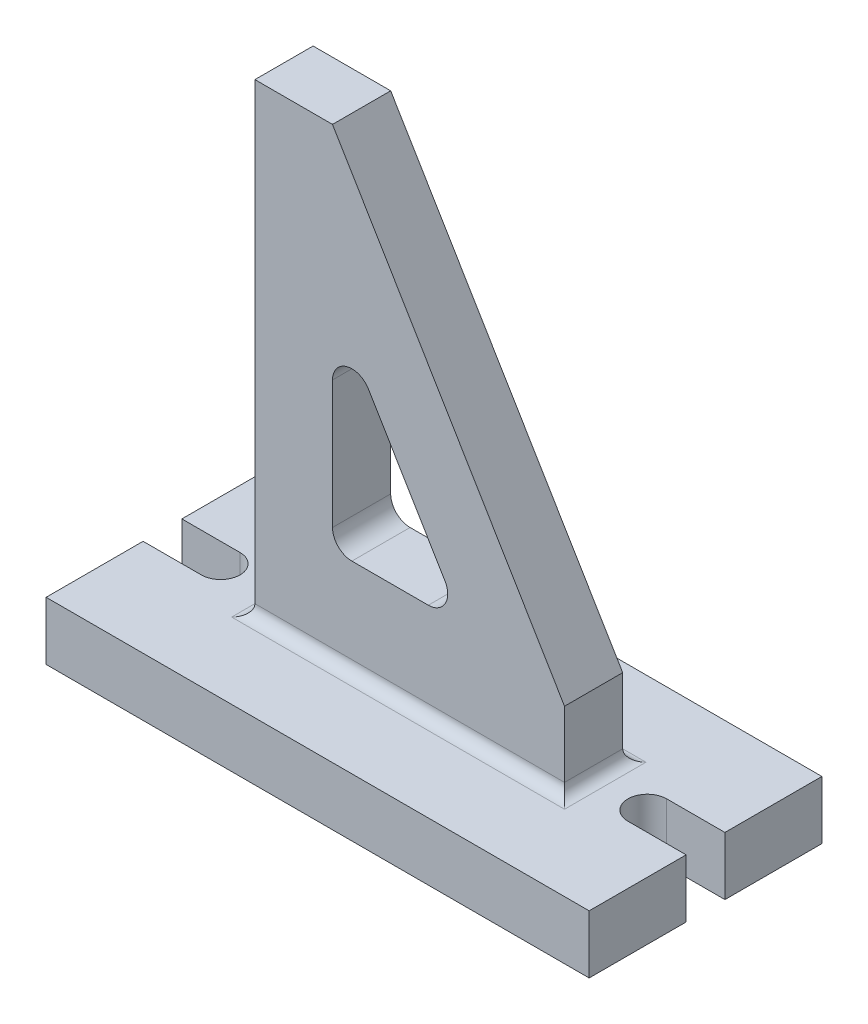
ISO-10303-21;
HEADER;
FILE_DESCRIPTION(('STEP AP214'),'2;1');
FILE_NAME('part.step','',(''),(''),'','','');
FILE_SCHEMA(('AUTOMOTIVE_DESIGN { 1 0 10303 214 1 1 1 1 }'));
ENDSEC;
DATA;
#1=APPLICATION_CONTEXT('core data for automotive mechanical design processes');
#2=APPLICATION_PROTOCOL_DEFINITION('international standard','automotive_design',2000,#1);
#3=PRODUCT_CONTEXT('',#1,'mechanical');
#4=PRODUCT('Part','Part','',(#3));
#5=PRODUCT_RELATED_PRODUCT_CATEGORY('part','',(#4));
#6=PRODUCT_DEFINITION_FORMATION('','',#4);
#7=PRODUCT_DEFINITION_CONTEXT('part definition',#1,'design');
#8=PRODUCT_DEFINITION('design','',#6,#7);
#9=PRODUCT_DEFINITION_SHAPE('','',#8);
#10=(LENGTH_UNIT() NAMED_UNIT(*) SI_UNIT(.MILLI.,.METRE.));
#11=(NAMED_UNIT(*) PLANE_ANGLE_UNIT() SI_UNIT($,.RADIAN.));
#12=(NAMED_UNIT(*) SI_UNIT($,.STERADIAN.) SOLID_ANGLE_UNIT());
#13=UNCERTAINTY_MEASURE_WITH_UNIT(LENGTH_MEASURE(1.E-05),#10,'distance_accuracy_value','');
#14=(GEOMETRIC_REPRESENTATION_CONTEXT(3) GLOBAL_UNCERTAINTY_ASSIGNED_CONTEXT((#13)) GLOBAL_UNIT_ASSIGNED_CONTEXT((#10,
#11,#12)) REPRESENTATION_CONTEXT('',''));
#15=CARTESIAN_POINT('',(0.,0.,0.));
#16=DIRECTION('',(0.,0.,1.));
#17=DIRECTION('',(1.,0.,0.));
#18=AXIS2_PLACEMENT_3D('',#15,#16,#17);
#19=CARTESIAN_POINT('',(-36.4085501426287,0.,9.525));
#20=DIRECTION('',(1.,0.,0.));
#21=DIRECTION('',(0.,0.,-1.));
#22=AXIS2_PLACEMENT_3D('',#19,#20,#21);
#23=PLANE('',#22);
#24=DIRECTION('',(0.,-1.,0.));
#25=VECTOR('',#24,1.);
#26=CARTESIAN_POINT('',(-36.4085501426287,0.,-9.525));
#27=LINE('',#26,#25);
#28=CARTESIAN_POINT('',(-36.4085501426287,76.2,-9.525));
#29=VERTEX_POINT('',#28);
#30=CARTESIAN_POINT('',(-36.4085501426287,3.81,-9.525));
#31=VERTEX_POINT('',#30);
#32=EDGE_CURVE('E271',#29,#31,#27,.T.);
#33=ORIENTED_EDGE('',*,*,#32,.T.);
#34=DIRECTION('',(0.,0.,-1.));
#35=VECTOR('',#34,1.);
#36=CARTESIAN_POINT('',(-36.4085501426287,3.81,9.525));
#37=LINE('',#36,#35);
#38=CARTESIAN_POINT('',(-36.4085501426287,3.81,9.525));
#39=VERTEX_POINT('',#38);
#40=EDGE_CURVE('E11',#31,#39,#37,.F.);
#41=ORIENTED_EDGE('',*,*,#40,.T.);
#42=DIRECTION('',(0.,-1.,0.));
#43=VECTOR('',#42,1.);
#44=CARTESIAN_POINT('',(-36.4085501426287,0.,9.525));
#45=LINE('',#44,#43);
#46=CARTESIAN_POINT('',(-36.4085501426287,76.2,9.525));
#47=VERTEX_POINT('',#46);
#48=EDGE_CURVE('E261',#47,#39,#45,.T.);
#49=ORIENTED_EDGE('',*,*,#48,.F.);
#50=DIRECTION('',(0.,0.,1.));
#51=VECTOR('',#50,1.);
#52=CARTESIAN_POINT('',(-36.4085501426287,76.2,9.525));
#53=LINE('',#52,#51);
#54=EDGE_CURVE('E383',#29,#47,#53,.T.);
#55=ORIENTED_EDGE('',*,*,#54,.F.);
#56=EDGE_LOOP('',(#33,#41,#49,#55));
#57=FACE_BOUND('',#56,.T.);
#58=ADVANCED_FACE('F34',(#57),#23,.F.);
#59=CARTESIAN_POINT('',(-76.2,0.,38.1));
#60=DIRECTION('',(0.,1.,0.));
#61=DIRECTION('',(0.,0.,1.));
#62=AXIS2_PLACEMENT_3D('',#59,#60,#61);
#63=PLANE('',#62);
#64=DIRECTION('',(0.,0.,-1.));
#65=VECTOR('',#64,1.);
#66=CARTESIAN_POINT('',(-40.2185501426287,0.,38.1));
#67=LINE('',#66,#65);
#68=CARTESIAN_POINT('',(-40.2185501426287,0.,13.335));
#69=VERTEX_POINT('',#68);
#70=CARTESIAN_POINT('',(-40.2185501426287,0.,-13.335));
#71=VERTEX_POINT('',#70);
#72=EDGE_CURVE('E386',#69,#71,#67,.T.);
#73=ORIENTED_EDGE('',*,*,#72,.T.);
#74=DIRECTION('',(1.,0.,0.));
#75=VECTOR('',#74,1.);
#76=CARTESIAN_POINT('',(64.9592380234778,0.,-13.335));
#77=LINE('',#76,#75);
#78=CARTESIAN_POINT('',(68.7692380234778,0.,-13.335));
#79=VERTEX_POINT('',#78);
#80=EDGE_CURVE('E392',#71,#79,#77,.T.);
#81=ORIENTED_EDGE('',*,*,#80,.T.);
#82=DIRECTION('',(0.,0.,-1.));
#83=VECTOR('',#82,1.);
#84=CARTESIAN_POINT('',(68.7692380234778,0.,38.1));
#85=LINE('',#84,#83);
#86=CARTESIAN_POINT('',(68.7692380234778,0.,13.335));
#87=VERTEX_POINT('',#86);
#88=EDGE_CURVE('E390',#79,#87,#85,.F.);
#89=ORIENTED_EDGE('',*,*,#88,.T.);
#90=DIRECTION('',(1.,0.,0.));
#91=VECTOR('',#90,1.);
#92=CARTESIAN_POINT('',(-76.2,0.,13.335));
#93=LINE('',#92,#91);
#94=EDGE_CURVE('E388',#87,#69,#93,.F.);
#95=ORIENTED_EDGE('',*,*,#94,.T.);
#96=EDGE_LOOP('',(#73,#81,#89,#95));
#97=FACE_BOUND('',#96,.T.);
#98=DIRECTION('',(1.,0.,0.));
#99=VECTOR('',#98,1.);
#100=CARTESIAN_POINT('',(101.6,0.,-6.35));
#101=LINE('',#100,#99);
#102=CARTESIAN_POINT('',(82.55,0.,-6.35));
#103=VERTEX_POINT('',#102);
#104=CARTESIAN_POINT('',(101.6,0.,-6.35));
#105=VERTEX_POINT('',#104);
#106=EDGE_CURVE('E290',#103,#105,#101,.T.);
#107=ORIENTED_EDGE('',*,*,#106,.T.);
#108=DIRECTION('',(0.,0.,-1.));
#109=VECTOR('',#108,1.);
#110=CARTESIAN_POINT('',(101.6,0.,-38.1));
#111=LINE('',#110,#109);
#112=CARTESIAN_POINT('',(101.6,0.,-38.1));
#113=VERTEX_POINT('',#112);
#114=EDGE_CURVE('E356',#105,#113,#111,.T.);
#115=ORIENTED_EDGE('',*,*,#114,.T.);
#116=DIRECTION('',(-1.,0.,0.));
#117=VECTOR('',#116,1.);
#118=CARTESIAN_POINT('',(-76.2,0.,-38.1));
#119=LINE('',#118,#117);
#120=CARTESIAN_POINT('',(-76.2,0.,-38.1));
#121=VERTEX_POINT('',#120);
#122=EDGE_CURVE('E360',#113,#121,#119,.T.);
#123=ORIENTED_EDGE('',*,*,#122,.T.);
#124=DIRECTION('',(0.,0.,1.));
#125=VECTOR('',#124,1.);
#126=CARTESIAN_POINT('',(-76.2,0.,-38.1));
#127=LINE('',#126,#125);
#128=CARTESIAN_POINT('',(-76.2,0.,-6.34999999999999));
#129=VERTEX_POINT('',#128);
#130=EDGE_CURVE('E350',#121,#129,#127,.T.);
#131=ORIENTED_EDGE('',*,*,#130,.T.);
#132=DIRECTION('',(-1.,0.,0.));
#133=VECTOR('',#132,1.);
#134=CARTESIAN_POINT('',(-76.2,0.,-6.34999999999999));
#135=LINE('',#134,#133);
#136=CARTESIAN_POINT('',(-57.15,0.,-6.35));
#137=VERTEX_POINT('',#136);
#138=EDGE_CURVE('E313',#137,#129,#135,.T.);
#139=ORIENTED_EDGE('',*,*,#138,.F.);
#140=CARTESIAN_POINT('',(-57.15,0.,0.));
#141=DIRECTION('',(0.,1.,0.));
#142=DIRECTION('',(0.,0.,-1.));
#143=AXIS2_PLACEMENT_3D('',#140,#141,#142);
#144=CIRCLE('',#143,6.35);
#145=CARTESIAN_POINT('',(-57.15,0.,6.35));
#146=VERTEX_POINT('',#145);
#147=EDGE_CURVE('E322',#146,#137,#144,.T.);
#148=ORIENTED_EDGE('',*,*,#147,.F.);
#149=DIRECTION('',(1.,0.,0.));
#150=VECTOR('',#149,1.);
#151=CARTESIAN_POINT('',(-76.2,0.,6.35));
#152=LINE('',#151,#150);
#153=CARTESIAN_POINT('',(-76.2,0.,6.35));
#154=VERTEX_POINT('',#153);
#155=EDGE_CURVE('E303',#154,#146,#152,.T.);
#156=ORIENTED_EDGE('',*,*,#155,.F.);
#157=CARTESIAN_POINT('',(-76.2,0.,38.1));
#158=VERTEX_POINT('',#157);
#159=EDGE_CURVE('E329',#154,#158,#127,.T.);
#160=ORIENTED_EDGE('',*,*,#159,.T.);
#161=DIRECTION('',(1.,0.,0.));
#162=VECTOR('',#161,1.);
#163=CARTESIAN_POINT('',(-76.2,0.,38.1));
#164=LINE('',#163,#162);
#165=CARTESIAN_POINT('',(101.6,0.,38.1));
#166=VERTEX_POINT('',#165);
#167=EDGE_CURVE('E353',#158,#166,#164,.T.);
#168=ORIENTED_EDGE('',*,*,#167,.T.);
#169=CARTESIAN_POINT('',(101.6,0.,6.35));
#170=VERTEX_POINT('',#169);
#171=EDGE_CURVE('E357',#166,#170,#111,.T.);
#172=ORIENTED_EDGE('',*,*,#171,.T.);
#173=DIRECTION('',(-1.,0.,0.));
#174=VECTOR('',#173,1.);
#175=CARTESIAN_POINT('',(101.6,0.,6.35));
#176=LINE('',#175,#174);
#177=CARTESIAN_POINT('',(82.55,0.,6.35));
#178=VERTEX_POINT('',#177);
#179=EDGE_CURVE('E283',#170,#178,#176,.T.);
#180=ORIENTED_EDGE('',*,*,#179,.T.);
#181=CARTESIAN_POINT('',(82.55,0.,0.));
#182=DIRECTION('',(0.,-1.,0.));
#183=DIRECTION('',(0.,0.,-1.));
#184=AXIS2_PLACEMENT_3D('',#181,#182,#183);
#185=CIRCLE('',#184,6.35);
#186=EDGE_CURVE('E286',#178,#103,#185,.T.);
#187=ORIENTED_EDGE('',*,*,#186,.T.);
#188=EDGE_LOOP('',(#107,#115,#123,#131,#139,#148,#156,#160,#168,#172,#180,#187));
#189=FACE_BOUND('',#188,.T.);
#190=ADVANCED_FACE('F450',(#97,#189),#63,.T.);
#191=CARTESIAN_POINT('',(101.6,-19.05,-38.1));
#192=DIRECTION('',(1.,0.,0.));
#193=DIRECTION('',(0.,0.,-1.));
#194=AXIS2_PLACEMENT_3D('',#191,#192,#193);
#195=PLANE('',#194);
#196=DIRECTION('',(0.,-1.,0.));
#197=VECTOR('',#196,1.);
#198=CARTESIAN_POINT('',(101.6,0.,-6.35));
#199=LINE('',#198,#197);
#200=CARTESIAN_POINT('',(101.6,-19.05,-6.35));
#201=VERTEX_POINT('',#200);
#202=EDGE_CURVE('E300',#105,#201,#199,.T.);
#203=ORIENTED_EDGE('',*,*,#202,.T.);
#204=DIRECTION('',(0.,0.,-1.));
#205=VECTOR('',#204,1.);
#206=CARTESIAN_POINT('',(101.6,-19.05,-38.1));
#207=LINE('',#206,#205);
#208=CARTESIAN_POINT('',(101.6,-19.05,-38.1));
#209=VERTEX_POINT('',#208);
#210=EDGE_CURVE('E342',#201,#209,#207,.T.);
#211=ORIENTED_EDGE('',*,*,#210,.T.);
#212=DIRECTION('',(0.,1.,0.));
#213=VECTOR('',#212,1.);
#214=CARTESIAN_POINT('',(101.6,-19.05,-38.1));
#215=LINE('',#214,#213);
#216=EDGE_CURVE('E366',#209,#113,#215,.T.);
#217=ORIENTED_EDGE('',*,*,#216,.T.);
#218=ORIENTED_EDGE('',*,*,#114,.F.);
#219=EDGE_LOOP('',(#203,#211,#217,#218));
#220=FACE_BOUND('',#219,.T.);
#221=ADVANCED_FACE('F466',(#220),#195,.T.);
#222=CARTESIAN_POINT('',(-76.2,-19.05,-38.1));
#223=DIRECTION('',(-1.,0.,0.));
#224=DIRECTION('',(0.,0.,1.));
#225=AXIS2_PLACEMENT_3D('',#222,#223,#224);
#226=PLANE('',#225);
#227=DIRECTION('',(0.,1.,0.));
#228=VECTOR('',#227,1.);
#229=CARTESIAN_POINT('',(-76.2,-19.05,-6.34999999999999));
#230=LINE('',#229,#228);
#231=CARTESIAN_POINT('',(-76.2,-19.05,-6.34999999999999));
#232=VERTEX_POINT('',#231);
#233=EDGE_CURVE('E326',#232,#129,#230,.T.);
#234=ORIENTED_EDGE('',*,*,#233,.T.);
#235=ORIENTED_EDGE('',*,*,#130,.F.);
#236=DIRECTION('',(0.,1.,0.));
#237=VECTOR('',#236,1.);
#238=CARTESIAN_POINT('',(-76.2,-19.05,-38.1));
#239=LINE('',#238,#237);
#240=CARTESIAN_POINT('',(-76.2,-19.05,-38.1));
#241=VERTEX_POINT('',#240);
#242=EDGE_CURVE('E363',#241,#121,#239,.T.);
#243=ORIENTED_EDGE('',*,*,#242,.F.);
#244=DIRECTION('',(0.,0.,1.));
#245=VECTOR('',#244,1.);
#246=CARTESIAN_POINT('',(-76.2,-19.05,-38.1));
#247=LINE('',#246,#245);
#248=EDGE_CURVE('E335',#241,#232,#247,.T.);
#249=ORIENTED_EDGE('',*,*,#248,.T.);
#250=EDGE_LOOP('',(#234,#235,#243,#249));
#251=FACE_BOUND('',#250,.T.);
#252=ADVANCED_FACE('F537',(#251),#226,.T.);
#253=DIRECTION('',(0.,1.,0.));
#254=VECTOR('',#253,1.);
#255=CARTESIAN_POINT('',(-76.2,-19.05,6.35));
#256=LINE('',#255,#254);
#257=CARTESIAN_POINT('',(-76.2,-19.05,6.35));
#258=VERTEX_POINT('',#257);
#259=EDGE_CURVE('E319',#258,#154,#256,.T.);
#260=ORIENTED_EDGE('',*,*,#259,.F.);
#261=CARTESIAN_POINT('',(-76.2,-19.05,38.1));
#262=VERTEX_POINT('',#261);
#263=EDGE_CURVE('E339',#258,#262,#247,.T.);
#264=ORIENTED_EDGE('',*,*,#263,.T.);
#265=DIRECTION('',(0.,1.,0.));
#266=VECTOR('',#265,1.);
#267=CARTESIAN_POINT('',(-76.2,-19.05,38.1));
#268=LINE('',#267,#266);
#269=EDGE_CURVE('E349',#262,#158,#268,.T.);
#270=ORIENTED_EDGE('',*,*,#269,.T.);
#271=ORIENTED_EDGE('',*,*,#159,.F.);
#272=EDGE_LOOP('',(#260,#264,#270,#271));
#273=FACE_BOUND('',#272,.T.);
#274=ADVANCED_FACE('F527',(#273),#226,.T.);
#275=CARTESIAN_POINT('',(-76.2,-19.05,-38.1));
#276=DIRECTION('',(0.,0.,-1.));
#277=DIRECTION('',(-1.,0.,0.));
#278=AXIS2_PLACEMENT_3D('',#275,#276,#277);
#279=PLANE('',#278);
#280=ORIENTED_EDGE('',*,*,#122,.F.);
#281=ORIENTED_EDGE('',*,*,#216,.F.);
#282=DIRECTION('',(-1.,0.,0.));
#283=VECTOR('',#282,1.);
#284=CARTESIAN_POINT('',(-76.2,-19.05,-38.1));
#285=LINE('',#284,#283);
#286=EDGE_CURVE('E346',#209,#241,#285,.T.);
#287=ORIENTED_EDGE('',*,*,#286,.T.);
#288=ORIENTED_EDGE('',*,*,#242,.T.);
#289=EDGE_LOOP('',(#280,#281,#287,#288));
#290=FACE_BOUND('',#289,.T.);
#291=ADVANCED_FACE('F523',(#290),#279,.T.);
#292=DIRECTION('',(0.,-1.,0.));
#293=VECTOR('',#292,1.);
#294=CARTESIAN_POINT('',(101.6,0.,6.35));
#295=LINE('',#294,#293);
#296=CARTESIAN_POINT('',(101.6,-19.05,6.35));
#297=VERTEX_POINT('',#296);
#298=EDGE_CURVE('E293',#170,#297,#295,.T.);
#299=ORIENTED_EDGE('',*,*,#298,.F.);
#300=ORIENTED_EDGE('',*,*,#171,.F.);
#301=DIRECTION('',(0.,1.,0.));
#302=VECTOR('',#301,1.);
#303=CARTESIAN_POINT('',(101.6,-19.05,38.1));
#304=LINE('',#303,#302);
#305=CARTESIAN_POINT('',(101.6,-19.05,38.1));
#306=VERTEX_POINT('',#305);
#307=EDGE_CURVE('E369',#306,#166,#304,.T.);
#308=ORIENTED_EDGE('',*,*,#307,.F.);
#309=EDGE_CURVE('E343',#306,#297,#207,.T.);
#310=ORIENTED_EDGE('',*,*,#309,.T.);
#311=EDGE_LOOP('',(#299,#300,#308,#310));
#312=FACE_BOUND('',#311,.T.);
#313=ADVANCED_FACE('F526',(#312),#195,.T.);
#314=CARTESIAN_POINT('',(-76.2,-19.05,38.1));
#315=DIRECTION('',(0.,0.,1.));
#316=DIRECTION('',(1.,0.,0.));
#317=AXIS2_PLACEMENT_3D('',#314,#315,#316);
#318=PLANE('',#317);
#319=ORIENTED_EDGE('',*,*,#167,.F.);
#320=ORIENTED_EDGE('',*,*,#269,.F.);
#321=DIRECTION('',(1.,0.,0.));
#322=VECTOR('',#321,1.);
#323=CARTESIAN_POINT('',(-76.2,-19.05,38.1));
#324=LINE('',#323,#322);
#325=EDGE_CURVE('E338',#262,#306,#324,.T.);
#326=ORIENTED_EDGE('',*,*,#325,.T.);
#327=ORIENTED_EDGE('',*,*,#307,.T.);
#328=EDGE_LOOP('',(#319,#320,#326,#327));
#329=FACE_BOUND('',#328,.T.);
#330=ADVANCED_FACE('F520',(#329),#318,.T.);
#331=CARTESIAN_POINT('',(-76.2,-19.05,38.1));
#332=DIRECTION('',(0.,1.,0.));
#333=DIRECTION('',(0.,0.,1.));
#334=AXIS2_PLACEMENT_3D('',#331,#332,#333);
#335=PLANE('',#334);
#336=ORIENTED_EDGE('',*,*,#210,.F.);
#337=DIRECTION('',(1.,0.,0.));
#338=VECTOR('',#337,1.);
#339=CARTESIAN_POINT('',(101.6,-19.05,-6.35));
#340=LINE('',#339,#338);
#341=CARTESIAN_POINT('',(82.55,-19.05,-6.35));
#342=VERTEX_POINT('',#341);
#343=EDGE_CURVE('E287',#342,#201,#340,.T.);
#344=ORIENTED_EDGE('',*,*,#343,.F.);
#345=CARTESIAN_POINT('',(82.55,-19.05,0.));
#346=DIRECTION('',(0.,-1.,0.));
#347=DIRECTION('',(0.,0.,-1.));
#348=AXIS2_PLACEMENT_3D('',#345,#346,#347);
#349=CIRCLE('',#348,6.35);
#350=CARTESIAN_POINT('',(82.55,-19.05,6.35));
#351=VERTEX_POINT('',#350);
#352=EDGE_CURVE('E296',#351,#342,#349,.T.);
#353=ORIENTED_EDGE('',*,*,#352,.F.);
#354=DIRECTION('',(-1.,0.,0.));
#355=VECTOR('',#354,1.);
#356=CARTESIAN_POINT('',(101.6,-19.05,6.35));
#357=LINE('',#356,#355);
#358=EDGE_CURVE('E282',#297,#351,#357,.T.);
#359=ORIENTED_EDGE('',*,*,#358,.F.);
#360=ORIENTED_EDGE('',*,*,#309,.F.);
#361=ORIENTED_EDGE('',*,*,#325,.F.);
#362=ORIENTED_EDGE('',*,*,#263,.F.);
#363=DIRECTION('',(1.,0.,0.));
#364=VECTOR('',#363,1.);
#365=CARTESIAN_POINT('',(-76.2,-19.05,6.35));
#366=LINE('',#365,#364);
#367=CARTESIAN_POINT('',(-57.15,-19.05,6.35));
#368=VERTEX_POINT('',#367);
#369=EDGE_CURVE('E309',#258,#368,#366,.T.);
#370=ORIENTED_EDGE('',*,*,#369,.T.);
#371=CARTESIAN_POINT('',(-57.15,-19.05,0.));
#372=DIRECTION('',(0.,1.,0.));
#373=DIRECTION('',(0.,0.,-1.));
#374=AXIS2_PLACEMENT_3D('',#371,#372,#373);
#375=CIRCLE('',#374,6.35);
#376=CARTESIAN_POINT('',(-57.15,-19.05,-6.35));
#377=VERTEX_POINT('',#376);
#378=EDGE_CURVE('E312',#368,#377,#375,.T.);
#379=ORIENTED_EDGE('',*,*,#378,.T.);
#380=DIRECTION('',(-1.,0.,0.));
#381=VECTOR('',#380,1.);
#382=CARTESIAN_POINT('',(-76.2,-19.05,-6.34999999999999));
#383=LINE('',#382,#381);
#384=EDGE_CURVE('E316',#377,#232,#383,.T.);
#385=ORIENTED_EDGE('',*,*,#384,.T.);
#386=ORIENTED_EDGE('',*,*,#248,.F.);
#387=ORIENTED_EDGE('',*,*,#286,.F.);
#388=EDGE_LOOP('',(#336,#344,#353,#359,#360,#361,#362,#370,#379,#385,#386,#387));
#389=FACE_BOUND('',#388,.T.);
#390=ADVANCED_FACE('F511',(#389),#335,.F.);
#391=CARTESIAN_POINT('',(-76.2,-19.05,-6.34999999999999));
#392=DIRECTION('',(0.,0.,-1.));
#393=DIRECTION('',(-1.,0.,0.));
#394=AXIS2_PLACEMENT_3D('',#391,#392,#393);
#395=PLANE('',#394);
#396=ORIENTED_EDGE('',*,*,#138,.T.);
#397=ORIENTED_EDGE('',*,*,#233,.F.);
#398=ORIENTED_EDGE('',*,*,#384,.F.);
#399=DIRECTION('',(0.,1.,0.));
#400=VECTOR('',#399,1.);
#401=CARTESIAN_POINT('',(-57.15,-19.05,-6.35));
#402=LINE('',#401,#400);
#403=EDGE_CURVE('E330',#377,#137,#402,.T.);
#404=ORIENTED_EDGE('',*,*,#403,.T.);
#405=EDGE_LOOP('',(#396,#397,#398,#404));
#406=FACE_BOUND('',#405,.T.);
#407=ADVANCED_FACE('F507',(#406),#395,.F.);
#408=CARTESIAN_POINT('',(-57.15,-19.05,0.));
#409=DIRECTION('',(0.,1.,0.));
#410=DIRECTION('',(0.,0.,1.));
#411=AXIS2_PLACEMENT_3D('',#408,#409,#410);
#412=CYLINDRICAL_SURFACE('',#411,6.35);
#413=ORIENTED_EDGE('',*,*,#147,.T.);
#414=ORIENTED_EDGE('',*,*,#403,.F.);
#415=ORIENTED_EDGE('',*,*,#378,.F.);
#416=DIRECTION('',(0.,1.,0.));
#417=VECTOR('',#416,1.);
#418=CARTESIAN_POINT('',(-57.15,-19.05,6.35));
#419=LINE('',#418,#417);
#420=EDGE_CURVE('E332',#368,#146,#419,.T.);
#421=ORIENTED_EDGE('',*,*,#420,.T.);
#422=EDGE_LOOP('',(#413,#414,#415,#421));
#423=FACE_BOUND('',#422,.T.);
#424=ADVANCED_FACE('F510',(#423),#412,.F.);
#425=CARTESIAN_POINT('',(-76.2,-19.05,6.35));
#426=DIRECTION('',(0.,0.,1.));
#427=DIRECTION('',(1.,0.,0.));
#428=AXIS2_PLACEMENT_3D('',#425,#426,#427);
#429=PLANE('',#428);
#430=ORIENTED_EDGE('',*,*,#155,.T.);
#431=ORIENTED_EDGE('',*,*,#420,.F.);
#432=ORIENTED_EDGE('',*,*,#369,.F.);
#433=ORIENTED_EDGE('',*,*,#259,.T.);
#434=EDGE_LOOP('',(#430,#431,#432,#433));
#435=FACE_BOUND('',#434,.T.);
#436=ADVANCED_FACE('F502',(#435),#429,.F.);
#437=CARTESIAN_POINT('',(101.6,0.,-6.35));
#438=DIRECTION('',(0.,0.,-1.));
#439=DIRECTION('',(-1.,0.,0.));
#440=AXIS2_PLACEMENT_3D('',#437,#438,#439);
#441=PLANE('',#440);
#442=ORIENTED_EDGE('',*,*,#343,.T.);
#443=ORIENTED_EDGE('',*,*,#202,.F.);
#444=ORIENTED_EDGE('',*,*,#106,.F.);
#445=DIRECTION('',(0.,-1.,0.));
#446=VECTOR('',#445,1.);
#447=CARTESIAN_POINT('',(82.55,0.,-6.35));
#448=LINE('',#447,#446);
#449=EDGE_CURVE('E304',#103,#342,#448,.T.);
#450=ORIENTED_EDGE('',*,*,#449,.T.);
#451=EDGE_LOOP('',(#442,#443,#444,#450));
#452=FACE_BOUND('',#451,.T.);
#453=ADVANCED_FACE('F499',(#452),#441,.F.);
#454=CARTESIAN_POINT('',(82.55,0.,0.));
#455=DIRECTION('',(0.,-1.,0.));
#456=DIRECTION('',(0.,0.,-1.));
#457=AXIS2_PLACEMENT_3D('',#454,#455,#456);
#458=CYLINDRICAL_SURFACE('',#457,6.35);
#459=ORIENTED_EDGE('',*,*,#352,.T.);
#460=ORIENTED_EDGE('',*,*,#449,.F.);
#461=ORIENTED_EDGE('',*,*,#186,.F.);
#462=DIRECTION('',(0.,-1.,0.));
#463=VECTOR('',#462,1.);
#464=CARTESIAN_POINT('',(82.55,0.,6.35));
#465=LINE('',#464,#463);
#466=EDGE_CURVE('E306',#178,#351,#465,.T.);
#467=ORIENTED_EDGE('',*,*,#466,.T.);
#468=EDGE_LOOP('',(#459,#460,#461,#467));
#469=FACE_BOUND('',#468,.T.);
#470=ADVANCED_FACE('F495',(#469),#458,.F.);
#471=CARTESIAN_POINT('',(101.6,0.,6.35));
#472=DIRECTION('',(0.,0.,1.));
#473=DIRECTION('',(1.,0.,0.));
#474=AXIS2_PLACEMENT_3D('',#471,#472,#473);
#475=PLANE('',#474);
#476=ORIENTED_EDGE('',*,*,#358,.T.);
#477=ORIENTED_EDGE('',*,*,#466,.F.);
#478=ORIENTED_EDGE('',*,*,#179,.F.);
#479=ORIENTED_EDGE('',*,*,#298,.T.);
#480=EDGE_LOOP('',(#476,#477,#478,#479));
#481=FACE_BOUND('',#480,.T.);
#482=ADVANCED_FACE('F488',(#481),#475,.F.);
#483=CARTESIAN_POINT('',(64.9592380234778,0.,9.525));
#484=DIRECTION('',(-1.,0.,0.));
#485=DIRECTION('',(0.,0.,1.));
#486=AXIS2_PLACEMENT_3D('',#483,#484,#485);
#487=PLANE('',#486);
#488=DIRECTION('',(0.,1.,0.));
#489=VECTOR('',#488,1.);
#490=CARTESIAN_POINT('',(64.9592380234778,0.,9.525));
#491=LINE('',#490,#489);
#492=CARTESIAN_POINT('',(64.9592380234778,3.81,9.525));
#493=VERTEX_POINT('',#492);
#494=CARTESIAN_POINT('',(64.9592380234778,25.4,9.525));
#495=VERTEX_POINT('',#494);
#496=EDGE_CURVE('E254',#493,#495,#491,.T.);
#497=ORIENTED_EDGE('',*,*,#496,.F.);
#498=DIRECTION('',(0.,0.,-1.));
#499=VECTOR('',#498,1.);
#500=CARTESIAN_POINT('',(64.9592380234778,3.81,9.525));
#501=LINE('',#500,#499);
#502=CARTESIAN_POINT('',(64.9592380234778,3.81,-9.525));
#503=VERTEX_POINT('',#502);
#504=EDGE_CURVE('E398',#493,#503,#501,.T.);
#505=ORIENTED_EDGE('',*,*,#504,.T.);
#506=DIRECTION('',(0.,1.,0.));
#507=VECTOR('',#506,1.);
#508=CARTESIAN_POINT('',(64.9592380234778,0.,-9.525));
#509=LINE('',#508,#507);
#510=CARTESIAN_POINT('',(64.9592380234778,25.4,-9.525));
#511=VERTEX_POINT('',#510);
#512=EDGE_CURVE('E247',#503,#511,#509,.T.);
#513=ORIENTED_EDGE('',*,*,#512,.T.);
#514=DIRECTION('',(0.,0.,-1.));
#515=VECTOR('',#514,1.);
#516=CARTESIAN_POINT('',(64.9592380234778,25.4,9.525));
#517=LINE('',#516,#515);
#518=EDGE_CURVE('E279',#495,#511,#517,.T.);
#519=ORIENTED_EDGE('',*,*,#518,.F.);
#520=EDGE_LOOP('',(#497,#505,#513,#519));
#521=FACE_BOUND('',#520,.T.);
#522=ADVANCED_FACE('F486',(#521),#487,.F.);
#523=CARTESIAN_POINT('',(64.9592380234778,25.4,9.525));
#524=DIRECTION('',(-0.85818441643584,-0.513341511458674,0.));
#525=DIRECTION('',(0.513341511458674,-0.85818441643584,0.));
#526=AXIS2_PLACEMENT_3D('',#523,#524,#525);
#527=PLANE('',#526);
#528=DIRECTION('',(-0.513341511458674,0.85818441643584,0.));
#529=VECTOR('',#528,1.);
#530=CARTESIAN_POINT('',(64.9592380234778,25.4,-9.525));
#531=LINE('',#530,#529);
#532=CARTESIAN_POINT('',(-11.0085501426287,152.4,-9.525));
#533=VERTEX_POINT('',#532);
#534=EDGE_CURVE('E267',#511,#533,#531,.T.);
#535=ORIENTED_EDGE('',*,*,#534,.T.);
#536=DIRECTION('',(0.,0.,-1.));
#537=VECTOR('',#536,1.);
#538=CARTESIAN_POINT('',(-11.0085501426287,152.4,9.525));
#539=LINE('',#538,#537);
#540=CARTESIAN_POINT('',(-11.0085501426287,152.4,9.525));
#541=VERTEX_POINT('',#540);
#542=EDGE_CURVE('E276',#541,#533,#539,.T.);
#543=ORIENTED_EDGE('',*,*,#542,.F.);
#544=DIRECTION('',(-0.513341511458674,0.85818441643584,0.));
#545=VECTOR('',#544,1.);
#546=CARTESIAN_POINT('',(64.9592380234778,25.4,9.525));
#547=LINE('',#546,#545);
#548=EDGE_CURVE('E256',#495,#541,#547,.T.);
#549=ORIENTED_EDGE('',*,*,#548,.F.);
#550=ORIENTED_EDGE('',*,*,#518,.T.);
#551=EDGE_LOOP('',(#535,#543,#549,#550));
#552=FACE_BOUND('',#551,.T.);
#553=ADVANCED_FACE('F477',(#552),#527,.F.);
#554=CARTESIAN_POINT('',(-36.4085501426287,152.4,9.525));
#555=DIRECTION('',(0.,-1.,0.));
#556=DIRECTION('',(0.,0.,-1.));
#557=AXIS2_PLACEMENT_3D('',#554,#555,#556);
#558=PLANE('',#557);
#559=DIRECTION('',(-1.,0.,0.));
#560=VECTOR('',#559,1.);
#561=CARTESIAN_POINT('',(-36.4085501426287,152.4,-9.525));
#562=LINE('',#561,#560);
#563=CARTESIAN_POINT('',(-36.4085501426287,152.4,-9.525));
#564=VERTEX_POINT('',#563);
#565=EDGE_CURVE('E269',#533,#564,#562,.T.);
#566=ORIENTED_EDGE('',*,*,#565,.T.);
#567=DIRECTION('',(0.,0.,-1.));
#568=VECTOR('',#567,1.);
#569=CARTESIAN_POINT('',(-36.4085501426287,152.4,9.525));
#570=LINE('',#569,#568);
#571=CARTESIAN_POINT('',(-36.4085501426287,152.4,9.525));
#572=VERTEX_POINT('',#571);
#573=EDGE_CURVE('E265',#572,#564,#570,.T.);
#574=ORIENTED_EDGE('',*,*,#573,.F.);
#575=DIRECTION('',(-1.,0.,0.));
#576=VECTOR('',#575,1.);
#577=CARTESIAN_POINT('',(-36.4085501426287,152.4,9.525));
#578=LINE('',#577,#576);
#579=EDGE_CURVE('E259',#541,#572,#578,.T.);
#580=ORIENTED_EDGE('',*,*,#579,.F.);
#581=ORIENTED_EDGE('',*,*,#542,.T.);
#582=EDGE_LOOP('',(#566,#574,#580,#581));
#583=FACE_BOUND('',#582,.T.);
#584=ADVANCED_FACE('F470',(#583),#558,.F.);
#585=EDGE_CURVE('E257',#564,#29,#27,.T.);
#586=ORIENTED_EDGE('',*,*,#585,.T.);
#587=ORIENTED_EDGE('',*,*,#54,.T.);
#588=EDGE_CURVE('E262',#572,#47,#45,.T.);
#589=ORIENTED_EDGE('',*,*,#588,.F.);
#590=ORIENTED_EDGE('',*,*,#573,.T.);
#591=EDGE_LOOP('',(#586,#587,#589,#590));
#592=FACE_BOUND('',#591,.T.);
#593=ADVANCED_FACE('F462',(#592),#23,.F.);
#594=CARTESIAN_POINT('',(-36.4085501426287,0.,9.525));
#595=DIRECTION('',(0.,0.,-1.));
#596=DIRECTION('',(-1.,0.,0.));
#597=AXIS2_PLACEMENT_3D('',#594,#595,#596);
#598=PLANE('',#597);
#599=DIRECTION('',(-0.513341511458674,0.85818441643584,0.));
#600=VECTOR('',#599,1.);
#601=CARTESIAN_POINT('',(25.8152202295564,41.3597185977627,9.525));
#602=LINE('',#601,#600);
#603=CARTESIAN_POINT('',(25.8152202295564,41.3597185977627,9.525));
#604=VERTEX_POINT('',#603);
#605=CARTESIAN_POINT('',(0.790920901739016,83.1943710386603,9.525));
#606=VERTEX_POINT('',#605);
#607=EDGE_CURVE('E224',#604,#606,#602,.T.);
#608=ORIENTED_EDGE('',*,*,#607,.F.);
#609=CARTESIAN_POINT('',(20.3657491851888,38.1,9.525));
#610=DIRECTION('',(0.,0.,1.));
#611=DIRECTION('',(-1.,0.,0.));
#612=AXIS2_PLACEMENT_3D('',#609,#610,#611);
#613=CIRCLE('',#612,6.35);
#614=CARTESIAN_POINT('',(20.3657491851887,31.75,9.525));
#615=VERTEX_POINT('',#614);
#616=EDGE_CURVE('E229',#615,#604,#613,.T.);
#617=ORIENTED_EDGE('',*,*,#616,.F.);
#618=DIRECTION('',(1.,0.,0.));
#619=VECTOR('',#618,1.);
#620=CARTESIAN_POINT('',(-4.65855014262867,31.75,9.525));
#621=LINE('',#620,#619);
#622=CARTESIAN_POINT('',(-4.65855014262867,31.75,9.525));
#623=VERTEX_POINT('',#622);
#624=EDGE_CURVE('E242',#623,#615,#621,.T.);
#625=ORIENTED_EDGE('',*,*,#624,.F.);
#626=CARTESIAN_POINT('',(-4.65855014262872,38.1,9.525));
#627=DIRECTION('',(0.,0.,1.));
#628=DIRECTION('',(-1.,0.,0.));
#629=AXIS2_PLACEMENT_3D('',#626,#627,#628);
#630=CIRCLE('',#629,6.35);
#631=CARTESIAN_POINT('',(-11.0085501426287,38.1,9.525));
#632=VERTEX_POINT('',#631);
#633=EDGE_CURVE('E236',#632,#623,#630,.T.);
#634=ORIENTED_EDGE('',*,*,#633,.F.);
#635=DIRECTION('',(0.,-1.,0.));
#636=VECTOR('',#635,1.);
#637=CARTESIAN_POINT('',(-11.0085501426287,79.9346524408977,9.525));
#638=LINE('',#637,#636);
#639=CARTESIAN_POINT('',(-11.0085501426287,79.9346524408977,9.525));
#640=VERTEX_POINT('',#639);
#641=EDGE_CURVE('E234',#640,#632,#638,.T.);
#642=ORIENTED_EDGE('',*,*,#641,.F.);
#643=CARTESIAN_POINT('',(-4.65855014262873,79.934652440898,9.525));
#644=DIRECTION('',(0.,0.,1.));
#645=DIRECTION('',(1.,0.,0.));
#646=AXIS2_PLACEMENT_3D('',#643,#644,#645);
#647=CIRCLE('',#646,6.34999999999999);
#648=EDGE_CURVE('E213',#606,#640,#647,.T.);
#649=ORIENTED_EDGE('',*,*,#648,.F.);
#650=EDGE_LOOP('',(#608,#617,#625,#634,#642,#649));
#651=FACE_BOUND('',#650,.T.);
#652=ORIENTED_EDGE('',*,*,#48,.T.);
#653=DIRECTION('',(1.,0.,0.));
#654=VECTOR('',#653,1.);
#655=CARTESIAN_POINT('',(-36.4085501426287,3.81,9.525));
#656=LINE('',#655,#654);
#657=EDGE_CURVE('E43',#39,#493,#656,.T.);
#658=ORIENTED_EDGE('',*,*,#657,.T.);
#659=ORIENTED_EDGE('',*,*,#496,.T.);
#660=ORIENTED_EDGE('',*,*,#548,.T.);
#661=ORIENTED_EDGE('',*,*,#579,.T.);
#662=ORIENTED_EDGE('',*,*,#588,.T.);
#663=EDGE_LOOP('',(#652,#658,#659,#660,#661,#662));
#664=FACE_BOUND('',#663,.T.);
#665=ADVANCED_FACE('F231',(#651,#664),#598,.F.);
#666=CARTESIAN_POINT('',(-36.4085501426287,0.,-9.525));
#667=DIRECTION('',(0.,0.,-1.));
#668=DIRECTION('',(-1.,0.,0.));
#669=AXIS2_PLACEMENT_3D('',#666,#667,#668);
#670=PLANE('',#669);
#671=CARTESIAN_POINT('',(20.3657491851888,38.1,-9.525));
#672=DIRECTION('',(0.,0.,-1.));
#673=DIRECTION('',(-1.,0.,0.));
#674=AXIS2_PLACEMENT_3D('',#671,#672,#673);
#675=CIRCLE('',#674,6.35);
#676=CARTESIAN_POINT('',(25.8152202295564,41.3597185977627,-9.525));
#677=VERTEX_POINT('',#676);
#678=CARTESIAN_POINT('',(20.3657491851887,31.75,-9.525));
#679=VERTEX_POINT('',#678);
#680=EDGE_CURVE('E381',#677,#679,#675,.T.);
#681=ORIENTED_EDGE('',*,*,#680,.F.);
#682=DIRECTION('',(0.513341511458674,-0.85818441643584,0.));
#683=VECTOR('',#682,1.);
#684=CARTESIAN_POINT('',(27.6387230538618,38.3112573449429,-9.525));
#685=LINE('',#684,#683);
#686=CARTESIAN_POINT('',(0.790920901739024,83.1943710386603,-9.525));
#687=VERTEX_POINT('',#686);
#688=EDGE_CURVE('E365',#687,#677,#685,.T.);
#689=ORIENTED_EDGE('',*,*,#688,.F.);
#690=CARTESIAN_POINT('',(-4.65855014262873,79.934652440898,-9.525));
#691=DIRECTION('',(0.,0.,-1.));
#692=DIRECTION('',(-1.,0.,0.));
#693=AXIS2_PLACEMENT_3D('',#690,#691,#692);
#694=CIRCLE('',#693,6.34999999999999);
#695=CARTESIAN_POINT('',(-11.0085501426287,79.9346524408977,-9.525));
#696=VERTEX_POINT('',#695);
#697=EDGE_CURVE('E216',#696,#687,#694,.T.);
#698=ORIENTED_EDGE('',*,*,#697,.F.);
#699=DIRECTION('',(0.,1.,0.));
#700=VECTOR('',#699,1.);
#701=CARTESIAN_POINT('',(-11.0085501426287,0.,-9.525));
#702=LINE('',#701,#700);
#703=CARTESIAN_POINT('',(-11.0085501426287,38.1,-9.525));
#704=VERTEX_POINT('',#703);
#705=EDGE_CURVE('E375',#704,#696,#702,.T.);
#706=ORIENTED_EDGE('',*,*,#705,.F.);
#707=CARTESIAN_POINT('',(-4.65855014262872,38.1,-9.525));
#708=DIRECTION('',(0.,0.,-1.));
#709=DIRECTION('',(-1.,0.,0.));
#710=AXIS2_PLACEMENT_3D('',#707,#708,#709);
#711=CIRCLE('',#710,6.35);
#712=CARTESIAN_POINT('',(-4.65855014262867,31.75,-9.525));
#713=VERTEX_POINT('',#712);
#714=EDGE_CURVE('E377',#713,#704,#711,.T.);
#715=ORIENTED_EDGE('',*,*,#714,.F.);
#716=DIRECTION('',(-1.,0.,0.));
#717=VECTOR('',#716,1.);
#718=CARTESIAN_POINT('',(-36.4085501426287,31.75,-9.525));
#719=LINE('',#718,#717);
#720=EDGE_CURVE('E379',#679,#713,#719,.T.);
#721=ORIENTED_EDGE('',*,*,#720,.F.);
#722=EDGE_LOOP('',(#681,#689,#698,#706,#715,#721));
#723=FACE_BOUND('',#722,.T.);
#724=ORIENTED_EDGE('',*,*,#512,.F.);
#725=DIRECTION('',(1.,0.,0.));
#726=VECTOR('',#725,1.);
#727=CARTESIAN_POINT('',(-36.4085501426287,3.81,-9.525));
#728=LINE('',#727,#726);
#729=EDGE_CURVE('E395',#503,#31,#728,.F.);
#730=ORIENTED_EDGE('',*,*,#729,.T.);
#731=ORIENTED_EDGE('',*,*,#32,.F.);
#732=ORIENTED_EDGE('',*,*,#585,.F.);
#733=ORIENTED_EDGE('',*,*,#565,.F.);
#734=ORIENTED_EDGE('',*,*,#534,.F.);
#735=EDGE_LOOP('',(#724,#730,#731,#732,#733,#734));
#736=FACE_BOUND('',#735,.T.);
#737=ADVANCED_FACE('F431',(#723,#736),#670,.T.);
#738=CARTESIAN_POINT('',(20.3657491851888,38.1,-38.1));
#739=DIRECTION('',(0.,0.,1.));
#740=DIRECTION('',(1.,0.,0.));
#741=AXIS2_PLACEMENT_3D('',#738,#739,#740);
#742=CYLINDRICAL_SURFACE('',#741,6.35);
#743=ORIENTED_EDGE('',*,*,#680,.T.);
#744=DIRECTION('',(0.,0.,1.));
#745=VECTOR('',#744,1.);
#746=CARTESIAN_POINT('',(20.3657491851887,31.75,-38.1));
#747=LINE('',#746,#745);
#748=EDGE_CURVE('E245',#679,#615,#747,.T.);
#749=ORIENTED_EDGE('',*,*,#748,.T.);
#750=ORIENTED_EDGE('',*,*,#616,.T.);
#751=DIRECTION('',(0.,0.,1.));
#752=VECTOR('',#751,1.);
#753=CARTESIAN_POINT('',(25.8152202295564,41.3597185977627,-38.1));
#754=LINE('',#753,#752);
#755=EDGE_CURVE('E220',#677,#604,#754,.T.);
#756=ORIENTED_EDGE('',*,*,#755,.F.);
#757=EDGE_LOOP('',(#743,#749,#750,#756));
#758=FACE_BOUND('',#757,.T.);
#759=ADVANCED_FACE('F415',(#758),#742,.F.);
#760=CARTESIAN_POINT('',(-4.65855014262867,31.75,-38.1));
#761=DIRECTION('',(0.,-1.,0.));
#762=DIRECTION('',(0.,0.,-1.));
#763=AXIS2_PLACEMENT_3D('',#760,#761,#762);
#764=PLANE('',#763);
#765=ORIENTED_EDGE('',*,*,#720,.T.);
#766=DIRECTION('',(0.,0.,1.));
#767=VECTOR('',#766,1.);
#768=CARTESIAN_POINT('',(-4.65855014262867,31.75,-38.1));
#769=LINE('',#768,#767);
#770=EDGE_CURVE('E248',#713,#623,#769,.T.);
#771=ORIENTED_EDGE('',*,*,#770,.T.);
#772=ORIENTED_EDGE('',*,*,#624,.T.);
#773=ORIENTED_EDGE('',*,*,#748,.F.);
#774=EDGE_LOOP('',(#765,#771,#772,#773));
#775=FACE_BOUND('',#774,.T.);
#776=ADVANCED_FACE('F420',(#775),#764,.F.);
#777=CARTESIAN_POINT('',(-4.65855014262872,38.1,-38.1));
#778=DIRECTION('',(0.,0.,1.));
#779=DIRECTION('',(1.,0.,0.));
#780=AXIS2_PLACEMENT_3D('',#777,#778,#779);
#781=CYLINDRICAL_SURFACE('',#780,6.35);
#782=ORIENTED_EDGE('',*,*,#714,.T.);
#783=DIRECTION('',(0.,0.,1.));
#784=VECTOR('',#783,1.);
#785=CARTESIAN_POINT('',(-11.0085501426287,38.1,-38.1));
#786=LINE('',#785,#784);
#787=EDGE_CURVE('E250',#704,#632,#786,.T.);
#788=ORIENTED_EDGE('',*,*,#787,.T.);
#789=ORIENTED_EDGE('',*,*,#633,.T.);
#790=ORIENTED_EDGE('',*,*,#770,.F.);
#791=EDGE_LOOP('',(#782,#788,#789,#790));
#792=FACE_BOUND('',#791,.T.);
#793=ADVANCED_FACE('F425',(#792),#781,.F.);
#794=CARTESIAN_POINT('',(-11.0085501426287,79.9346524408977,-38.1));
#795=DIRECTION('',(-1.,0.,0.));
#796=DIRECTION('',(0.,-1.,0.));
#797=AXIS2_PLACEMENT_3D('',#794,#795,#796);
#798=PLANE('',#797);
#799=ORIENTED_EDGE('',*,*,#705,.T.);
#800=DIRECTION('',(0.,0.,1.));
#801=VECTOR('',#800,1.);
#802=CARTESIAN_POINT('',(-11.0085501426287,79.9346524408977,-38.1));
#803=LINE('',#802,#801);
#804=EDGE_CURVE('E219',#696,#640,#803,.T.);
#805=ORIENTED_EDGE('',*,*,#804,.T.);
#806=ORIENTED_EDGE('',*,*,#641,.T.);
#807=ORIENTED_EDGE('',*,*,#787,.F.);
#808=EDGE_LOOP('',(#799,#805,#806,#807));
#809=FACE_BOUND('',#808,.T.);
#810=ADVANCED_FACE('F429',(#809),#798,.F.);
#811=CARTESIAN_POINT('',(-4.65855014262873,79.934652440898,-38.1));
#812=DIRECTION('',(0.,0.,1.));
#813=DIRECTION('',(1.,0.,0.));
#814=AXIS2_PLACEMENT_3D('',#811,#812,#813);
#815=CYLINDRICAL_SURFACE('',#814,6.34999999999999);
#816=ORIENTED_EDGE('',*,*,#697,.T.);
#817=DIRECTION('',(0.,0.,1.));
#818=VECTOR('',#817,1.);
#819=CARTESIAN_POINT('',(0.790920901739016,83.1943710386603,-38.1));
#820=LINE('',#819,#818);
#821=EDGE_CURVE('E208',#687,#606,#820,.T.);
#822=ORIENTED_EDGE('',*,*,#821,.T.);
#823=ORIENTED_EDGE('',*,*,#648,.T.);
#824=ORIENTED_EDGE('',*,*,#804,.F.);
#825=EDGE_LOOP('',(#816,#822,#823,#824));
#826=FACE_BOUND('',#825,.T.);
#827=ADVANCED_FACE('F210',(#826),#815,.F.);
#828=CARTESIAN_POINT('',(25.8152202295564,41.3597185977627,-38.1));
#829=DIRECTION('',(0.85818441643584,0.513341511458674,0.));
#830=DIRECTION('',(-0.513341511458674,0.85818441643584,0.));
#831=AXIS2_PLACEMENT_3D('',#828,#829,#830);
#832=PLANE('',#831);
#833=ORIENTED_EDGE('',*,*,#688,.T.);
#834=ORIENTED_EDGE('',*,*,#755,.T.);
#835=ORIENTED_EDGE('',*,*,#607,.T.);
#836=ORIENTED_EDGE('',*,*,#821,.F.);
#837=EDGE_LOOP('',(#833,#834,#835,#836));
#838=FACE_BOUND('',#837,.T.);
#839=ADVANCED_FACE('F225',(#838),#832,.F.);
#840=CARTESIAN_POINT('',(-36.4085501426287,3.81,13.335));
#841=DIRECTION('',(1.,0.,0.));
#842=DIRECTION('',(0.,0.,-1.));
#843=AXIS2_PLACEMENT_3D('',#840,#841,#842);
#844=CYLINDRICAL_SURFACE('',#843,3.81);
#845=CARTESIAN_POINT('',(68.7692380234778,3.81,13.335));
#846=DIRECTION('',(0.707106781186547,0.,-0.707106781186547));
#847=DIRECTION('',(0.707106781186547,0.,0.707106781186547));
#848=AXIS2_PLACEMENT_3D('',#845,#846,#847);
#849=ELLIPSE('',#848,5.38815367264149,3.81);
#850=EDGE_CURVE('E404',#493,#87,#849,.F.);
#851=ORIENTED_EDGE('',*,*,#850,.F.);
#852=ORIENTED_EDGE('',*,*,#657,.F.);
#853=CARTESIAN_POINT('',(-40.2185501426287,3.81,13.335));
#854=DIRECTION('',(-0.707106781186547,0.,-0.707106781186547));
#855=DIRECTION('',(0.707106781186547,0.,-0.707106781186547));
#856=AXIS2_PLACEMENT_3D('',#853,#854,#855);
#857=ELLIPSE('',#856,5.38815367264149,3.81);
#858=EDGE_CURVE('E38',#69,#39,#857,.F.);
#859=ORIENTED_EDGE('',*,*,#858,.F.);
#860=ORIENTED_EDGE('',*,*,#94,.F.);
#861=EDGE_LOOP('',(#851,#852,#859,#860));
#862=FACE_BOUND('',#861,.T.);
#863=ADVANCED_FACE('F36',(#862),#844,.F.);
#864=CARTESIAN_POINT('',(-40.2185501426287,3.81,38.1));
#865=DIRECTION('',(0.,0.,-1.));
#866=DIRECTION('',(-1.,0.,0.));
#867=AXIS2_PLACEMENT_3D('',#864,#865,#866);
#868=CYLINDRICAL_SURFACE('',#867,3.81);
#869=ORIENTED_EDGE('',*,*,#858,.T.);
#870=ORIENTED_EDGE('',*,*,#40,.F.);
#871=CARTESIAN_POINT('',(-40.2185501426287,3.81,-13.335));
#872=DIRECTION('',(0.707106781186547,0.,-0.707106781186547));
#873=DIRECTION('',(-0.707106781186547,0.,-0.707106781186547));
#874=AXIS2_PLACEMENT_3D('',#871,#872,#873);
#875=ELLIPSE('',#874,5.38815367264149,3.81);
#876=EDGE_CURVE('E403',#71,#31,#875,.F.);
#877=ORIENTED_EDGE('',*,*,#876,.F.);
#878=ORIENTED_EDGE('',*,*,#72,.F.);
#879=EDGE_LOOP('',(#869,#870,#877,#878));
#880=FACE_BOUND('',#879,.T.);
#881=ADVANCED_FACE('F452',(#880),#868,.F.);
#882=CARTESIAN_POINT('',(68.7692380234778,3.81,9.525));
#883=DIRECTION('',(0.,0.,-1.));
#884=DIRECTION('',(-1.,0.,0.));
#885=AXIS2_PLACEMENT_3D('',#882,#883,#884);
#886=CYLINDRICAL_SURFACE('',#885,3.81);
#887=ORIENTED_EDGE('',*,*,#850,.T.);
#888=ORIENTED_EDGE('',*,*,#88,.F.);
#889=CARTESIAN_POINT('',(68.7692380234778,3.81,-13.335));
#890=DIRECTION('',(-0.707106781186547,0.,-0.707106781186547));
#891=DIRECTION('',(0.707106781186547,0.,-0.707106781186547));
#892=AXIS2_PLACEMENT_3D('',#889,#890,#891);
#893=ELLIPSE('',#892,5.38815367264149,3.81);
#894=EDGE_CURVE('E401',#503,#79,#893,.F.);
#895=ORIENTED_EDGE('',*,*,#894,.F.);
#896=ORIENTED_EDGE('',*,*,#504,.F.);
#897=EDGE_LOOP('',(#887,#888,#895,#896));
#898=FACE_BOUND('',#897,.T.);
#899=ADVANCED_FACE('F447',(#898),#886,.F.);
#900=CARTESIAN_POINT('',(-76.2,3.81,-13.335));
#901=DIRECTION('',(-1.,0.,0.));
#902=DIRECTION('',(0.,0.,1.));
#903=AXIS2_PLACEMENT_3D('',#900,#901,#902);
#904=CYLINDRICAL_SURFACE('',#903,3.81);
#905=ORIENTED_EDGE('',*,*,#876,.T.);
#906=ORIENTED_EDGE('',*,*,#729,.F.);
#907=ORIENTED_EDGE('',*,*,#894,.T.);
#908=ORIENTED_EDGE('',*,*,#80,.F.);
#909=EDGE_LOOP('',(#905,#906,#907,#908));
#910=FACE_BOUND('',#909,.T.);
#911=ADVANCED_FACE('F444',(#910),#904,.F.);
#912=CLOSED_SHELL('',(#58,#190,#221,#252,#274,#291,#313,#330,#390,#407,#424,#436,#453,#470,#482,
#522,#553,#584,#593,#665,#737,#759,#776,#793,#810,#827,#839,#863,#881,#899,#911));
#913=MANIFOLD_SOLID_BREP('B2',#912);
#914=ADVANCED_BREP_SHAPE_REPRESENTATION('',(#18,#913),#14);
#915=SHAPE_DEFINITION_REPRESENTATION(#9,#914);
ENDSEC;
END-ISO-10303-21;
